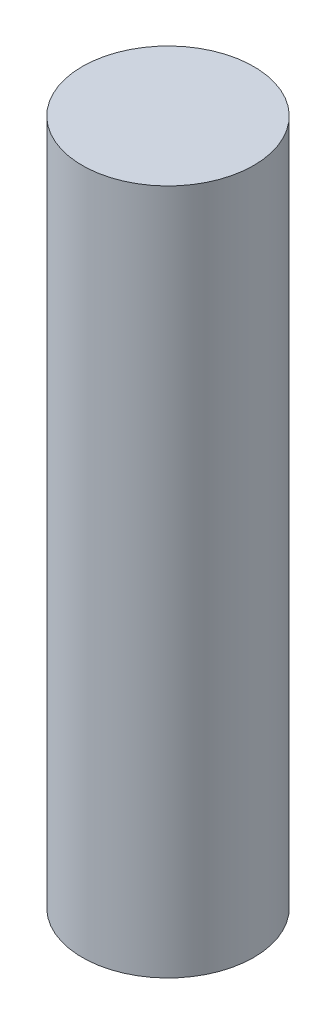
ISO-10303-21;
HEADER;
FILE_DESCRIPTION(('STEP AP214'),'2;1');
FILE_NAME('part.step','',(''),(''),'','','');
FILE_SCHEMA(('AUTOMOTIVE_DESIGN { 1 0 10303 214 1 1 1 1 }'));
ENDSEC;
DATA;
#1=APPLICATION_CONTEXT('core data for automotive mechanical design processes');
#2=APPLICATION_PROTOCOL_DEFINITION('international standard','automotive_design',2000,#1);
#3=PRODUCT_CONTEXT('',#1,'mechanical');
#4=PRODUCT('Part','Part','',(#3));
#5=PRODUCT_RELATED_PRODUCT_CATEGORY('part','',(#4));
#6=PRODUCT_DEFINITION_FORMATION('','',#4);
#7=PRODUCT_DEFINITION_CONTEXT('part definition',#1,'design');
#8=PRODUCT_DEFINITION('design','',#6,#7);
#9=PRODUCT_DEFINITION_SHAPE('','',#8);
#10=(LENGTH_UNIT() NAMED_UNIT(*) SI_UNIT(.MILLI.,.METRE.));
#11=(NAMED_UNIT(*) PLANE_ANGLE_UNIT() SI_UNIT($,.RADIAN.));
#12=(NAMED_UNIT(*) SI_UNIT($,.STERADIAN.) SOLID_ANGLE_UNIT());
#13=UNCERTAINTY_MEASURE_WITH_UNIT(LENGTH_MEASURE(1.E-05),#10,'distance_accuracy_value','');
#14=(GEOMETRIC_REPRESENTATION_CONTEXT(3) GLOBAL_UNCERTAINTY_ASSIGNED_CONTEXT((#13)) GLOBAL_UNIT_ASSIGNED_CONTEXT((#10,
#11,#12)) REPRESENTATION_CONTEXT('',''));
#15=CARTESIAN_POINT('',(0.,0.,0.));
#16=DIRECTION('',(0.,0.,1.));
#17=DIRECTION('',(1.,0.,0.));
#18=AXIS2_PLACEMENT_3D('',#15,#16,#17);
#19=CARTESIAN_POINT('',(-51.0739629900006,99.6470504536898,22.7150767026163));
#20=DIRECTION('',(0.,-1.,0.));
#21=DIRECTION('',(1.,0.,0.));
#22=AXIS2_PLACEMENT_3D('',#19,#20,#21);
#23=PLANE('',#22);
#24=CARTESIAN_POINT('',(-57.3239629900006,99.6470504536898,22.7150767026163));
#25=DIRECTION('',(0.,-1.,0.));
#26=DIRECTION('',(1.,0.,0.));
#27=AXIS2_PLACEMENT_3D('',#24,#25,#26);
#28=CIRCLE('',#27,6.25);
#29=CARTESIAN_POINT('',(-51.0739629900006,99.6470504536898,22.7150767026163));
#30=VERTEX_POINT('',#29);
#31=EDGE_CURVE('E19',#30,#30,#28,.T.);
#32=ORIENTED_EDGE('',*,*,#31,.F.);
#33=EDGE_LOOP('',(#32));
#34=FACE_BOUND('',#33,.T.);
#35=ADVANCED_FACE('F15',(#34),#23,.F.);
#36=CARTESIAN_POINT('',(-51.0739629900006,49.6470504536898,22.7150767026163));
#37=DIRECTION('',(0.,-1.,0.));
#38=DIRECTION('',(1.,0.,0.));
#39=AXIS2_PLACEMENT_3D('',#36,#37,#38);
#40=PLANE('',#39);
#41=CARTESIAN_POINT('',(-57.3239629900006,49.6470504536898,22.7150767026163));
#42=DIRECTION('',(0.,-1.,0.));
#43=DIRECTION('',(1.,0.,0.));
#44=AXIS2_PLACEMENT_3D('',#41,#42,#43);
#45=CIRCLE('',#44,6.25);
#46=CARTESIAN_POINT('',(-51.0739629900006,49.6470504536898,22.7150767026163));
#47=VERTEX_POINT('',#46);
#48=EDGE_CURVE('E10',#47,#47,#45,.F.);
#49=ORIENTED_EDGE('',*,*,#48,.F.);
#50=EDGE_LOOP('',(#49));
#51=FACE_BOUND('',#50,.T.);
#52=ADVANCED_FACE('F30',(#51),#40,.T.);
#53=CARTESIAN_POINT('',(-57.3239629900006,99.6470504536898,22.7150767026163));
#54=DIRECTION('',(0.,-1.,0.));
#55=DIRECTION('',(1.,0.,0.));
#56=AXIS2_PLACEMENT_3D('',#53,#54,#55);
#57=CYLINDRICAL_SURFACE('',#56,6.25);
#58=ORIENTED_EDGE('',*,*,#31,.T.);
#59=EDGE_LOOP('',(#58));
#60=FACE_BOUND('',#59,.T.);
#61=ORIENTED_EDGE('',*,*,#48,.T.);
#62=EDGE_LOOP('',(#61));
#63=FACE_BOUND('',#62,.T.);
#64=ADVANCED_FACE('F17',(#60,#63),#57,.T.);
#65=CLOSED_SHELL('',(#35,#52,#64));
#66=MANIFOLD_SOLID_BREP('B1',#65);
#67=ADVANCED_BREP_SHAPE_REPRESENTATION('',(#18,#66),#14);
#68=SHAPE_DEFINITION_REPRESENTATION(#9,#67);
ENDSEC;
END-ISO-10303-21;
